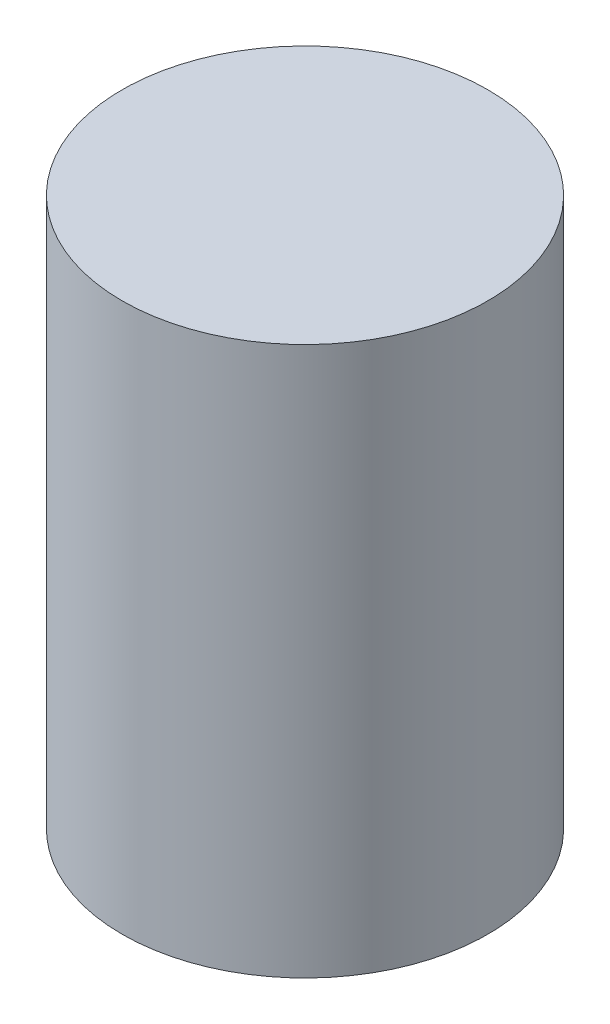
ISO-10303-21;
HEADER;
FILE_DESCRIPTION(('STEP AP214'),'2;1');
FILE_NAME('part.step','',(''),(''),'','','');
FILE_SCHEMA(('AUTOMOTIVE_DESIGN { 1 0 10303 214 1 1 1 1 }'));
ENDSEC;
DATA;
#1=APPLICATION_CONTEXT('core data for automotive mechanical design processes');
#2=APPLICATION_PROTOCOL_DEFINITION('international standard','automotive_design',2000,#1);
#3=PRODUCT_CONTEXT('',#1,'mechanical');
#4=PRODUCT('Part','Part','',(#3));
#5=PRODUCT_RELATED_PRODUCT_CATEGORY('part','',(#4));
#6=PRODUCT_DEFINITION_FORMATION('','',#4);
#7=PRODUCT_DEFINITION_CONTEXT('part definition',#1,'design');
#8=PRODUCT_DEFINITION('design','',#6,#7);
#9=PRODUCT_DEFINITION_SHAPE('','',#8);
#10=(LENGTH_UNIT() NAMED_UNIT(*) SI_UNIT(.MILLI.,.METRE.));
#11=(NAMED_UNIT(*) PLANE_ANGLE_UNIT() SI_UNIT($,.RADIAN.));
#12=(NAMED_UNIT(*) SI_UNIT($,.STERADIAN.) SOLID_ANGLE_UNIT());
#13=UNCERTAINTY_MEASURE_WITH_UNIT(LENGTH_MEASURE(1.E-05),#10,'distance_accuracy_value','');
#14=(GEOMETRIC_REPRESENTATION_CONTEXT(3) GLOBAL_UNCERTAINTY_ASSIGNED_CONTEXT((#13)) GLOBAL_UNIT_ASSIGNED_CONTEXT((#10,
#11,#12)) REPRESENTATION_CONTEXT('',''));
#15=CARTESIAN_POINT('',(0.,0.,0.));
#16=DIRECTION('',(0.,0.,1.));
#17=DIRECTION('',(1.,0.,0.));
#18=AXIS2_PLACEMENT_3D('',#15,#16,#17);
#19=CARTESIAN_POINT('',(0.,15.,0.));
#20=DIRECTION('',(0.,-1.,0.));
#21=DIRECTION('',(0.,0.,-1.));
#22=AXIS2_PLACEMENT_3D('',#19,#20,#21);
#23=CYLINDRICAL_SURFACE('',#22,5.);
#24=CARTESIAN_POINT('',(0.,15.,0.));
#25=DIRECTION('',(0.,1.,0.));
#26=DIRECTION('',(0.,0.,1.));
#27=AXIS2_PLACEMENT_3D('',#24,#25,#26);
#28=CIRCLE('',#27,5.);
#29=CARTESIAN_POINT('',(0.,15.,5.));
#30=VERTEX_POINT('',#29);
#31=EDGE_CURVE('E10',#30,#30,#28,.T.);
#32=ORIENTED_EDGE('',*,*,#31,.F.);
#33=EDGE_LOOP('',(#32));
#34=FACE_BOUND('',#33,.T.);
#35=CARTESIAN_POINT('',(0.,0.,0.));
#36=DIRECTION('',(0.,1.,0.));
#37=DIRECTION('',(0.,0.,1.));
#38=AXIS2_PLACEMENT_3D('',#35,#36,#37);
#39=CIRCLE('',#38,5.);
#40=CARTESIAN_POINT('',(0.,0.,5.));
#41=VERTEX_POINT('',#40);
#42=EDGE_CURVE('E41',#41,#41,#39,.T.);
#43=ORIENTED_EDGE('',*,*,#42,.T.);
#44=EDGE_LOOP('',(#43));
#45=FACE_BOUND('',#44,.T.);
#46=ADVANCED_FACE('F38',(#34,#45),#23,.T.);
#47=CARTESIAN_POINT('',(0.,15.,0.));
#48=DIRECTION('',(0.,1.,0.));
#49=DIRECTION('',(0.,0.,1.));
#50=AXIS2_PLACEMENT_3D('',#47,#48,#49);
#51=PLANE('',#50);
#52=ORIENTED_EDGE('',*,*,#31,.T.);
#53=EDGE_LOOP('',(#52));
#54=FACE_BOUND('',#53,.T.);
#55=ADVANCED_FACE('F59',(#54),#51,.T.);
#56=CARTESIAN_POINT('',(0.,0.,0.));
#57=DIRECTION('',(0.,1.,0.));
#58=DIRECTION('',(0.,0.,1.));
#59=AXIS2_PLACEMENT_3D('',#56,#57,#58);
#60=PLANE('',#59);
#61=ORIENTED_EDGE('',*,*,#42,.F.);
#62=EDGE_LOOP('',(#61));
#63=FACE_BOUND('',#62,.T.);
#64=ADVANCED_FACE('F57',(#63),#60,.F.);
#65=CLOSED_SHELL('',(#46,#55,#64));
#66=MANIFOLD_SOLID_BREP('B2',#65);
#67=ADVANCED_BREP_SHAPE_REPRESENTATION('',(#18,#66),#14);
#68=SHAPE_DEFINITION_REPRESENTATION(#9,#67);
ENDSEC;
END-ISO-10303-21;
